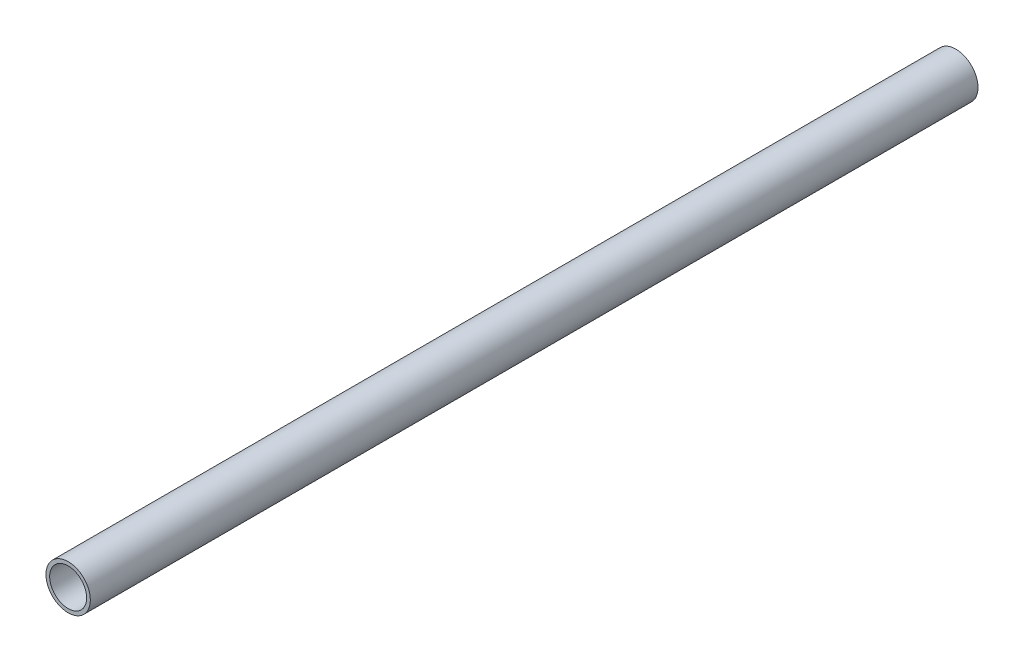
ISO-10303-21;
HEADER;
FILE_DESCRIPTION(('STEP AP214'),'2;1');
FILE_NAME('part.step','',(''),(''),'','','');
FILE_SCHEMA(('AUTOMOTIVE_DESIGN { 1 0 10303 214 1 1 1 1 }'));
ENDSEC;
DATA;
#1=APPLICATION_CONTEXT('core data for automotive mechanical design processes');
#2=APPLICATION_PROTOCOL_DEFINITION('international standard','automotive_design',2000,#1);
#3=PRODUCT_CONTEXT('',#1,'mechanical');
#4=PRODUCT('Part','Part','',(#3));
#5=PRODUCT_RELATED_PRODUCT_CATEGORY('part','',(#4));
#6=PRODUCT_DEFINITION_FORMATION('','',#4);
#7=PRODUCT_DEFINITION_CONTEXT('part definition',#1,'design');
#8=PRODUCT_DEFINITION('design','',#6,#7);
#9=PRODUCT_DEFINITION_SHAPE('','',#8);
#10=(LENGTH_UNIT() NAMED_UNIT(*) SI_UNIT(.MILLI.,.METRE.));
#11=(NAMED_UNIT(*) PLANE_ANGLE_UNIT() SI_UNIT($,.RADIAN.));
#12=(NAMED_UNIT(*) SI_UNIT($,.STERADIAN.) SOLID_ANGLE_UNIT());
#13=UNCERTAINTY_MEASURE_WITH_UNIT(LENGTH_MEASURE(1.E-05),#10,'distance_accuracy_value','');
#14=(GEOMETRIC_REPRESENTATION_CONTEXT(3) GLOBAL_UNCERTAINTY_ASSIGNED_CONTEXT((#13)) GLOBAL_UNIT_ASSIGNED_CONTEXT((#10,
#11,#12)) REPRESENTATION_CONTEXT('',''));
#15=CARTESIAN_POINT('',(0.,0.,0.));
#16=DIRECTION('',(0.,0.,1.));
#17=DIRECTION('',(1.,0.,0.));
#18=AXIS2_PLACEMENT_3D('',#15,#16,#17);
#19=CARTESIAN_POINT('',(0.,0.,480.));
#20=DIRECTION('',(0.,0.,1.));
#21=DIRECTION('',(1.,0.,0.));
#22=AXIS2_PLACEMENT_3D('',#19,#20,#21);
#23=PLANE('',#22);
#24=CARTESIAN_POINT('',(0.,0.,480.));
#25=DIRECTION('',(0.,0.,1.));
#26=DIRECTION('',(1.,0.,0.));
#27=AXIS2_PLACEMENT_3D('',#24,#25,#26);
#28=CIRCLE('',#27,12.);
#29=CARTESIAN_POINT('',(12.,0.,480.));
#30=VERTEX_POINT('',#29);
#31=EDGE_CURVE('E10',#30,#30,#28,.T.);
#32=ORIENTED_EDGE('',*,*,#31,.T.);
#33=EDGE_LOOP('',(#32));
#34=FACE_BOUND('',#33,.T.);
#35=CARTESIAN_POINT('',(0.,0.,480.));
#36=DIRECTION('',(0.,0.,1.));
#37=DIRECTION('',(1.,0.,0.));
#38=AXIS2_PLACEMENT_3D('',#35,#36,#37);
#39=CIRCLE('',#38,10.);
#40=CARTESIAN_POINT('',(10.,0.,480.));
#41=VERTEX_POINT('',#40);
#42=EDGE_CURVE('E50',#41,#41,#39,.T.);
#43=ORIENTED_EDGE('',*,*,#42,.F.);
#44=EDGE_LOOP('',(#43));
#45=FACE_BOUND('',#44,.T.);
#46=ADVANCED_FACE('F37',(#34,#45),#23,.T.);
#47=CARTESIAN_POINT('',(0.,0.,0.));
#48=DIRECTION('',(0.,0.,1.));
#49=DIRECTION('',(1.,0.,0.));
#50=AXIS2_PLACEMENT_3D('',#47,#48,#49);
#51=PLANE('',#50);
#52=CARTESIAN_POINT('',(0.,0.,0.));
#53=DIRECTION('',(0.,0.,1.));
#54=DIRECTION('',(1.,0.,0.));
#55=AXIS2_PLACEMENT_3D('',#52,#53,#54);
#56=CIRCLE('',#55,12.);
#57=CARTESIAN_POINT('',(12.,0.,0.));
#58=VERTEX_POINT('',#57);
#59=EDGE_CURVE('E41',#58,#58,#56,.T.);
#60=ORIENTED_EDGE('',*,*,#59,.F.);
#61=EDGE_LOOP('',(#60));
#62=FACE_BOUND('',#61,.T.);
#63=CARTESIAN_POINT('',(0.,0.,0.));
#64=DIRECTION('',(0.,0.,1.));
#65=DIRECTION('',(1.,0.,0.));
#66=AXIS2_PLACEMENT_3D('',#63,#64,#65);
#67=CIRCLE('',#66,10.);
#68=CARTESIAN_POINT('',(10.,0.,0.));
#69=VERTEX_POINT('',#68);
#70=EDGE_CURVE('E52',#69,#69,#67,.T.);
#71=ORIENTED_EDGE('',*,*,#70,.T.);
#72=EDGE_LOOP('',(#71));
#73=FACE_BOUND('',#72,.T.);
#74=ADVANCED_FACE('F64',(#62,#73),#51,.F.);
#75=CARTESIAN_POINT('',(0.,0.,480.));
#76=DIRECTION('',(0.,0.,-1.));
#77=DIRECTION('',(-1.,0.,0.));
#78=AXIS2_PLACEMENT_3D('',#75,#76,#77);
#79=CYLINDRICAL_SURFACE('',#78,12.);
#80=ORIENTED_EDGE('',*,*,#31,.F.);
#81=EDGE_LOOP('',(#80));
#82=FACE_BOUND('',#81,.T.);
#83=ORIENTED_EDGE('',*,*,#59,.T.);
#84=EDGE_LOOP('',(#83));
#85=FACE_BOUND('',#84,.T.);
#86=ADVANCED_FACE('F39',(#82,#85),#79,.T.);
#87=CARTESIAN_POINT('',(0.,0.,480.));
#88=DIRECTION('',(0.,0.,-1.));
#89=DIRECTION('',(-1.,0.,0.));
#90=AXIS2_PLACEMENT_3D('',#87,#88,#89);
#91=CYLINDRICAL_SURFACE('',#90,10.);
#92=ORIENTED_EDGE('',*,*,#42,.T.);
#93=EDGE_LOOP('',(#92));
#94=FACE_BOUND('',#93,.T.);
#95=ORIENTED_EDGE('',*,*,#70,.F.);
#96=EDGE_LOOP('',(#95));
#97=FACE_BOUND('',#96,.T.);
#98=ADVANCED_FACE('F60',(#94,#97),#91,.F.);
#99=CLOSED_SHELL('',(#46,#74,#86,#98));
#100=MANIFOLD_SOLID_BREP('B2',#99);
#101=ADVANCED_BREP_SHAPE_REPRESENTATION('',(#18,#100),#14);
#102=SHAPE_DEFINITION_REPRESENTATION(#9,#101);
ENDSEC;
END-ISO-10303-21;
